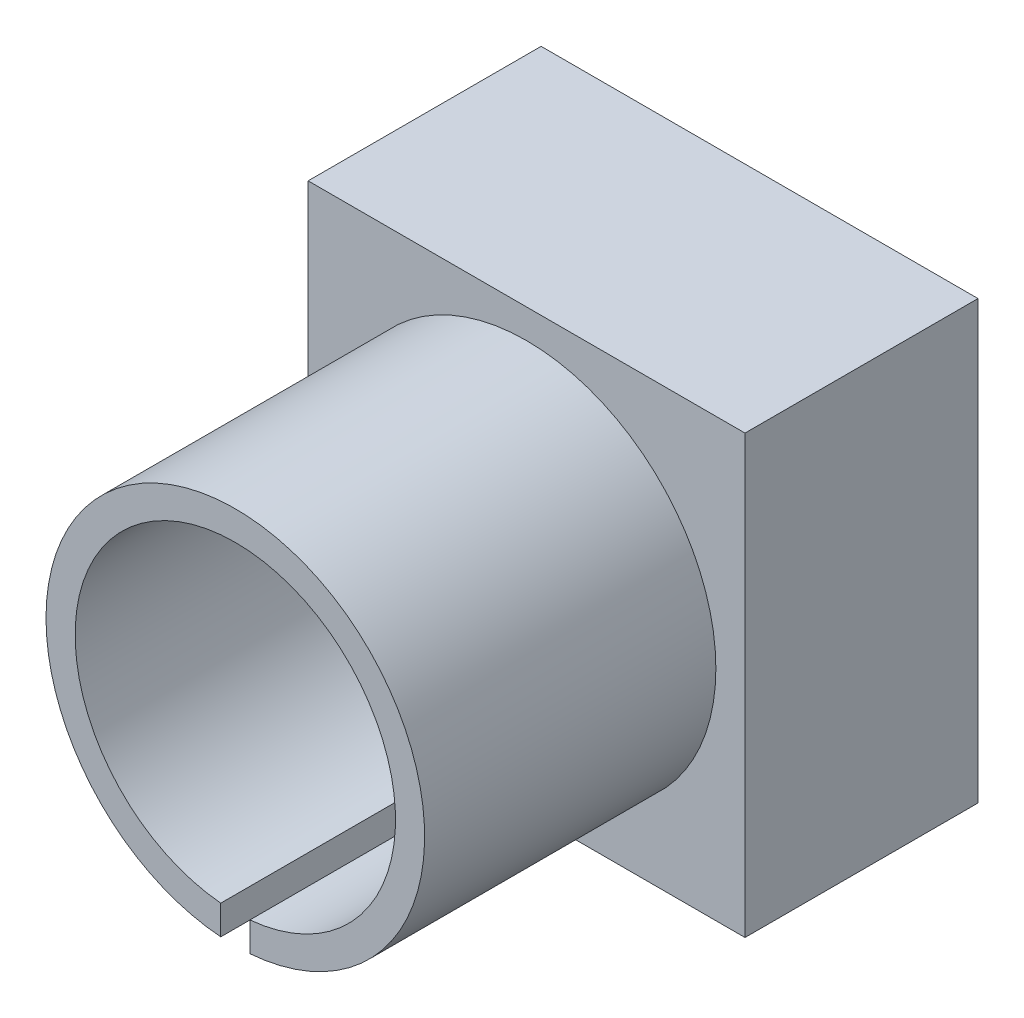
ISO-10303-21;
HEADER;
FILE_DESCRIPTION(('STEP AP214'),'2;1');
FILE_NAME('part.step','',(''),(''),'','','');
FILE_SCHEMA(('AUTOMOTIVE_DESIGN { 1 0 10303 214 1 1 1 1 }'));
ENDSEC;
DATA;
#1=APPLICATION_CONTEXT('core data for automotive mechanical design processes');
#2=APPLICATION_PROTOCOL_DEFINITION('international standard','automotive_design',2000,#1);
#3=PRODUCT_CONTEXT('',#1,'mechanical');
#4=PRODUCT('Part','Part','',(#3));
#5=PRODUCT_RELATED_PRODUCT_CATEGORY('part','',(#4));
#6=PRODUCT_DEFINITION_FORMATION('','',#4);
#7=PRODUCT_DEFINITION_CONTEXT('part definition',#1,'design');
#8=PRODUCT_DEFINITION('design','',#6,#7);
#9=PRODUCT_DEFINITION_SHAPE('','',#8);
#10=(LENGTH_UNIT() NAMED_UNIT(*) SI_UNIT(.MILLI.,.METRE.));
#11=(NAMED_UNIT(*) PLANE_ANGLE_UNIT() SI_UNIT($,.RADIAN.));
#12=(NAMED_UNIT(*) SI_UNIT($,.STERADIAN.) SOLID_ANGLE_UNIT());
#13=UNCERTAINTY_MEASURE_WITH_UNIT(LENGTH_MEASURE(1.E-05),#10,'distance_accuracy_value','');
#14=(GEOMETRIC_REPRESENTATION_CONTEXT(3) GLOBAL_UNCERTAINTY_ASSIGNED_CONTEXT((#13)) GLOBAL_UNIT_ASSIGNED_CONTEXT((#10,
#11,#12)) REPRESENTATION_CONTEXT('',''));
#15=CARTESIAN_POINT('',(0.,0.,0.));
#16=DIRECTION('',(0.,0.,1.));
#17=DIRECTION('',(1.,0.,0.));
#18=AXIS2_PLACEMENT_3D('',#15,#16,#17);
#19=CARTESIAN_POINT('',(-2.,0.,10.001));
#20=DIRECTION('',(0.,0.,-1.));
#21=DIRECTION('',(-1.,0.,0.));
#22=AXIS2_PLACEMENT_3D('',#19,#20,#21);
#23=CYLINDRICAL_SURFACE('',#22,0.75);
#24=CARTESIAN_POINT('',(-2.,0.,-1.59999999999998));
#25=DIRECTION('',(0.,0.,-1.));
#26=DIRECTION('',(-1.,0.,0.));
#27=AXIS2_PLACEMENT_3D('',#24,#25,#26);
#28=CIRCLE('',#27,0.75);
#29=CARTESIAN_POINT('',(-2.75,0.,-1.59999999999998));
#30=VERTEX_POINT('',#29);
#31=EDGE_CURVE('E53',#30,#30,#28,.T.);
#32=ORIENTED_EDGE('',*,*,#31,.T.);
#33=EDGE_LOOP('',(#32));
#34=FACE_BOUND('',#33,.T.);
#35=CARTESIAN_POINT('',(-2.,0.,0.));
#36=DIRECTION('',(0.,0.,-1.));
#37=DIRECTION('',(-1.,0.,0.));
#38=AXIS2_PLACEMENT_3D('',#35,#36,#37);
#39=CIRCLE('',#38,0.75);
#40=CARTESIAN_POINT('',(-2.75,0.,0.));
#41=VERTEX_POINT('',#40);
#42=EDGE_CURVE('E362',#41,#41,#39,.F.);
#43=ORIENTED_EDGE('',*,*,#42,.T.);
#44=EDGE_LOOP('',(#43));
#45=FACE_BOUND('',#44,.T.);
#46=ADVANCED_FACE('F43',(#34,#45),#23,.F.);
#47=CARTESIAN_POINT('',(-7.5,-7.5,-8.));
#48=DIRECTION('',(0.,-1.,0.));
#49=DIRECTION('',(1.,0.,0.));
#50=AXIS2_PLACEMENT_3D('',#47,#48,#49);
#51=PLANE('',#50);
#52=DIRECTION('',(1.,0.,0.));
#53=VECTOR('',#52,1.);
#54=CARTESIAN_POINT('',(-7.5,-7.5,0.));
#55=LINE('',#54,#53);
#56=CARTESIAN_POINT('',(-7.5,-7.5,0.));
#57=VERTEX_POINT('',#56);
#58=CARTESIAN_POINT('',(7.5,-7.5,0.));
#59=VERTEX_POINT('',#58);
#60=EDGE_CURVE('E148',#57,#59,#55,.T.);
#61=ORIENTED_EDGE('',*,*,#60,.F.);
#62=DIRECTION('',(0.,0.,1.));
#63=VECTOR('',#62,1.);
#64=CARTESIAN_POINT('',(-7.5,-7.5,-8.));
#65=LINE('',#64,#63);
#66=CARTESIAN_POINT('',(-7.5,-7.5,-8.));
#67=VERTEX_POINT('',#66);
#68=EDGE_CURVE('E69',#67,#57,#65,.T.);
#69=ORIENTED_EDGE('',*,*,#68,.F.);
#70=DIRECTION('',(1.,0.,0.));
#71=VECTOR('',#70,1.);
#72=CARTESIAN_POINT('',(-7.5,-7.5,-8.));
#73=LINE('',#72,#71);
#74=CARTESIAN_POINT('',(7.5,-7.5,-8.));
#75=VERTEX_POINT('',#74);
#76=EDGE_CURVE('E155',#67,#75,#73,.T.);
#77=ORIENTED_EDGE('',*,*,#76,.T.);
#78=DIRECTION('',(0.,0.,1.));
#79=VECTOR('',#78,1.);
#80=CARTESIAN_POINT('',(7.5,-7.5,-8.));
#81=LINE('',#80,#79);
#82=EDGE_CURVE('E167',#75,#59,#81,.T.);
#83=ORIENTED_EDGE('',*,*,#82,.T.);
#84=EDGE_LOOP('',(#61,#69,#77,#83));
#85=FACE_BOUND('',#84,.T.);
#86=ADVANCED_FACE('F216',(#85),#51,.T.);
#87=CARTESIAN_POINT('',(-7.5,7.5,-8.));
#88=DIRECTION('',(-1.,0.,0.));
#89=DIRECTION('',(0.,-1.,0.));
#90=AXIS2_PLACEMENT_3D('',#87,#88,#89);
#91=PLANE('',#90);
#92=DIRECTION('',(0.,-1.,0.));
#93=VECTOR('',#92,1.);
#94=CARTESIAN_POINT('',(-7.5,7.5,0.));
#95=LINE('',#94,#93);
#96=CARTESIAN_POINT('',(-7.5,7.5,0.));
#97=VERTEX_POINT('',#96);
#98=EDGE_CURVE('E158',#97,#57,#95,.T.);
#99=ORIENTED_EDGE('',*,*,#98,.F.);
#100=DIRECTION('',(0.,0.,1.));
#101=VECTOR('',#100,1.);
#102=CARTESIAN_POINT('',(-7.5,7.5,-8.));
#103=LINE('',#102,#101);
#104=CARTESIAN_POINT('',(-7.5,7.5,-8.));
#105=VERTEX_POINT('',#104);
#106=EDGE_CURVE('E183',#105,#97,#103,.T.);
#107=ORIENTED_EDGE('',*,*,#106,.F.);
#108=DIRECTION('',(0.,-1.,0.));
#109=VECTOR('',#108,1.);
#110=CARTESIAN_POINT('',(-7.5,7.5,-8.));
#111=LINE('',#110,#109);
#112=EDGE_CURVE('E164',#105,#67,#111,.T.);
#113=ORIENTED_EDGE('',*,*,#112,.T.);
#114=ORIENTED_EDGE('',*,*,#68,.T.);
#115=EDGE_LOOP('',(#99,#107,#113,#114));
#116=FACE_BOUND('',#115,.T.);
#117=ADVANCED_FACE('F221',(#116),#91,.T.);
#118=CARTESIAN_POINT('',(-7.5,7.5,-8.));
#119=DIRECTION('',(0.,-1.,0.));
#120=DIRECTION('',(1.,0.,0.));
#121=AXIS2_PLACEMENT_3D('',#118,#119,#120);
#122=PLANE('',#121);
#123=DIRECTION('',(1.,0.,0.));
#124=VECTOR('',#123,1.);
#125=CARTESIAN_POINT('',(-7.5,7.5,0.));
#126=LINE('',#125,#124);
#127=CARTESIAN_POINT('',(7.5,7.5,0.));
#128=VERTEX_POINT('',#127);
#129=EDGE_CURVE('E175',#97,#128,#126,.T.);
#130=ORIENTED_EDGE('',*,*,#129,.T.);
#131=DIRECTION('',(0.,0.,1.));
#132=VECTOR('',#131,1.);
#133=CARTESIAN_POINT('',(7.5,7.5,-8.));
#134=LINE('',#133,#132);
#135=CARTESIAN_POINT('',(7.5,7.5,-8.));
#136=VERTEX_POINT('',#135);
#137=EDGE_CURVE('E186',#136,#128,#134,.T.);
#138=ORIENTED_EDGE('',*,*,#137,.F.);
#139=DIRECTION('',(1.,0.,0.));
#140=VECTOR('',#139,1.);
#141=CARTESIAN_POINT('',(-7.5,7.5,-8.));
#142=LINE('',#141,#140);
#143=EDGE_CURVE('E161',#105,#136,#142,.T.);
#144=ORIENTED_EDGE('',*,*,#143,.F.);
#145=ORIENTED_EDGE('',*,*,#106,.T.);
#146=EDGE_LOOP('',(#130,#138,#144,#145));
#147=FACE_BOUND('',#146,.T.);
#148=ADVANCED_FACE('F253',(#147),#122,.F.);
#149=CARTESIAN_POINT('',(7.5,7.5,-8.));
#150=DIRECTION('',(-1.,0.,0.));
#151=DIRECTION('',(0.,-1.,0.));
#152=AXIS2_PLACEMENT_3D('',#149,#150,#151);
#153=PLANE('',#152);
#154=DIRECTION('',(0.,-1.,0.));
#155=VECTOR('',#154,1.);
#156=CARTESIAN_POINT('',(7.5,7.5,0.));
#157=LINE('',#156,#155);
#158=EDGE_CURVE('E171',#128,#59,#157,.T.);
#159=ORIENTED_EDGE('',*,*,#158,.T.);
#160=ORIENTED_EDGE('',*,*,#82,.F.);
#161=DIRECTION('',(0.,-1.,0.));
#162=VECTOR('',#161,1.);
#163=CARTESIAN_POINT('',(7.5,7.5,-8.));
#164=LINE('',#163,#162);
#165=EDGE_CURVE('E95',#136,#75,#164,.T.);
#166=ORIENTED_EDGE('',*,*,#165,.F.);
#167=ORIENTED_EDGE('',*,*,#137,.T.);
#168=EDGE_LOOP('',(#159,#160,#166,#167));
#169=FACE_BOUND('',#168,.T.);
#170=ADVANCED_FACE('F246',(#169),#153,.F.);
#171=CARTESIAN_POINT('',(0.,0.,-8.));
#172=DIRECTION('',(0.,0.,-1.));
#173=DIRECTION('',(-1.,0.,0.));
#174=AXIS2_PLACEMENT_3D('',#171,#172,#173);
#175=PLANE('',#174);
#176=CARTESIAN_POINT('',(-2.,0.,-8.));
#177=DIRECTION('',(0.,0.,-1.));
#178=DIRECTION('',(-1.,0.,0.));
#179=AXIS2_PLACEMENT_3D('',#176,#177,#178);
#180=CIRCLE('',#179,2.1);
#181=CARTESIAN_POINT('',(-4.1,0.,-8.));
#182=VERTEX_POINT('',#181);
#183=EDGE_CURVE('E366',#182,#182,#180,.T.);
#184=ORIENTED_EDGE('',*,*,#183,.F.);
#185=EDGE_LOOP('',(#184));
#186=FACE_BOUND('',#185,.T.);
#187=ORIENTED_EDGE('',*,*,#76,.F.);
#188=ORIENTED_EDGE('',*,*,#112,.F.);
#189=ORIENTED_EDGE('',*,*,#143,.T.);
#190=ORIENTED_EDGE('',*,*,#165,.T.);
#191=EDGE_LOOP('',(#187,#188,#189,#190));
#192=FACE_BOUND('',#191,.T.);
#193=ADVANCED_FACE('F243',(#186,#192),#175,.T.);
#194=CARTESIAN_POINT('',(0.,0.,0.));
#195=DIRECTION('',(0.,0.,-1.));
#196=DIRECTION('',(-1.,0.,0.));
#197=AXIS2_PLACEMENT_3D('',#194,#195,#196);
#198=PLANE('',#197);
#199=CARTESIAN_POINT('',(0.,0.,0.));
#200=DIRECTION('',(0.,0.,-1.));
#201=DIRECTION('',(-1.,0.,0.));
#202=AXIS2_PLACEMENT_3D('',#199,#200,#201);
#203=CIRCLE('',#202,6.5);
#204=CARTESIAN_POINT('',(-6.5,0.,0.));
#205=VERTEX_POINT('',#204);
#206=EDGE_CURVE('E127',#205,#205,#203,.F.);
#207=ORIENTED_EDGE('',*,*,#206,.F.);
#208=EDGE_LOOP('',(#207));
#209=FACE_BOUND('',#208,.T.);
#210=ORIENTED_EDGE('',*,*,#60,.T.);
#211=ORIENTED_EDGE('',*,*,#158,.F.);
#212=ORIENTED_EDGE('',*,*,#129,.F.);
#213=ORIENTED_EDGE('',*,*,#98,.T.);
#214=EDGE_LOOP('',(#210,#211,#212,#213));
#215=FACE_BOUND('',#214,.T.);
#216=ADVANCED_FACE('F242',(#209,#215),#198,.F.);
#217=CARTESIAN_POINT('',(0.,0.,10.));
#218=DIRECTION('',(0.,0.,-1.));
#219=DIRECTION('',(-1.,0.,0.));
#220=AXIS2_PLACEMENT_3D('',#217,#218,#219);
#221=CYLINDRICAL_SURFACE('',#220,5.5);
#222=DIRECTION('',(0.,0.,-1.));
#223=VECTOR('',#222,1.);
#224=CARTESIAN_POINT('',(-0.5,-5.47722557505166,10.));
#225=LINE('',#224,#223);
#226=CARTESIAN_POINT('',(-0.5,-5.47722557505166,3.));
#227=VERTEX_POINT('',#226);
#228=CARTESIAN_POINT('',(-0.5,-5.47722557505166,10.));
#229=VERTEX_POINT('',#228);
#230=EDGE_CURVE('E382',#227,#229,#225,.F.);
#231=ORIENTED_EDGE('',*,*,#230,.F.);
#232=CARTESIAN_POINT('',(0.,0.,3.));
#233=DIRECTION('',(0.,0.,-1.));
#234=DIRECTION('',(-1.,0.,0.));
#235=AXIS2_PLACEMENT_3D('',#232,#233,#234);
#236=CIRCLE('',#235,5.5);
#237=CARTESIAN_POINT('',(0.5,-5.47722557505166,3.));
#238=VERTEX_POINT('',#237);
#239=EDGE_CURVE('E136',#238,#227,#236,.T.);
#240=ORIENTED_EDGE('',*,*,#239,.F.);
#241=DIRECTION('',(0.,0.,-1.));
#242=VECTOR('',#241,1.);
#243=CARTESIAN_POINT('',(0.5,-5.47722557505166,10.));
#244=LINE('',#243,#242);
#245=CARTESIAN_POINT('',(0.5,-5.47722557505166,10.));
#246=VERTEX_POINT('',#245);
#247=EDGE_CURVE('E119',#246,#238,#244,.T.);
#248=ORIENTED_EDGE('',*,*,#247,.F.);
#249=CARTESIAN_POINT('',(0.,0.,10.));
#250=DIRECTION('',(0.,0.,1.));
#251=DIRECTION('',(1.,0.,0.));
#252=AXIS2_PLACEMENT_3D('',#249,#250,#251);
#253=CIRCLE('',#252,5.5);
#254=EDGE_CURVE('E135',#246,#229,#253,.T.);
#255=ORIENTED_EDGE('',*,*,#254,.T.);
#256=EDGE_LOOP('',(#231,#240,#248,#255));
#257=FACE_BOUND('',#256,.T.);
#258=CARTESIAN_POINT('',(0.,0.,0.));
#259=DIRECTION('',(0.,0.,1.));
#260=DIRECTION('',(1.,0.,0.));
#261=AXIS2_PLACEMENT_3D('',#258,#259,#260);
#262=CIRCLE('',#261,5.5);
#263=CARTESIAN_POINT('',(5.5,0.,0.));
#264=VERTEX_POINT('',#263);
#265=EDGE_CURVE('E144',#264,#264,#262,.T.);
#266=ORIENTED_EDGE('',*,*,#265,.F.);
#267=EDGE_LOOP('',(#266));
#268=FACE_BOUND('',#267,.T.);
#269=ADVANCED_FACE('F133',(#257,#268),#221,.F.);
#270=CARTESIAN_POINT('',(0.,0.,10.));
#271=DIRECTION('',(0.,0.,-1.));
#272=DIRECTION('',(-1.,0.,0.));
#273=AXIS2_PLACEMENT_3D('',#270,#271,#272);
#274=CYLINDRICAL_SURFACE('',#273,6.5);
#275=CARTESIAN_POINT('',(0.,0.,3.));
#276=DIRECTION('',(0.,0.,-1.));
#277=DIRECTION('',(-1.,0.,0.));
#278=AXIS2_PLACEMENT_3D('',#275,#276,#277);
#279=CIRCLE('',#278,6.5);
#280=CARTESIAN_POINT('',(0.5,-6.48074069840786,3.));
#281=VERTEX_POINT('',#280);
#282=CARTESIAN_POINT('',(-0.5,-6.48074069840786,3.));
#283=VERTEX_POINT('',#282);
#284=EDGE_CURVE('E197',#281,#283,#279,.T.);
#285=ORIENTED_EDGE('',*,*,#284,.T.);
#286=DIRECTION('',(0.,0.,-1.));
#287=VECTOR('',#286,1.);
#288=CARTESIAN_POINT('',(-0.5,-6.48074069840786,10.));
#289=LINE('',#288,#287);
#290=CARTESIAN_POINT('',(-0.5,-6.48074069840786,10.));
#291=VERTEX_POINT('',#290);
#292=EDGE_CURVE('E138',#283,#291,#289,.F.);
#293=ORIENTED_EDGE('',*,*,#292,.T.);
#294=CARTESIAN_POINT('',(0.,0.,10.));
#295=DIRECTION('',(0.,0.,1.));
#296=DIRECTION('',(1.,0.,0.));
#297=AXIS2_PLACEMENT_3D('',#294,#295,#296);
#298=CIRCLE('',#297,6.5);
#299=CARTESIAN_POINT('',(0.5,-6.48074069840786,10.));
#300=VERTEX_POINT('',#299);
#301=EDGE_CURVE('E143',#300,#291,#298,.T.);
#302=ORIENTED_EDGE('',*,*,#301,.F.);
#303=DIRECTION('',(0.,0.,-1.));
#304=VECTOR('',#303,1.);
#305=CARTESIAN_POINT('',(0.5,-6.48074069840786,10.));
#306=LINE('',#305,#304);
#307=EDGE_CURVE('E60',#300,#281,#306,.T.);
#308=ORIENTED_EDGE('',*,*,#307,.T.);
#309=EDGE_LOOP('',(#285,#293,#302,#308));
#310=FACE_BOUND('',#309,.T.);
#311=ORIENTED_EDGE('',*,*,#206,.T.);
#312=EDGE_LOOP('',(#311));
#313=FACE_BOUND('',#312,.T.);
#314=ADVANCED_FACE('F236',(#310,#313),#274,.T.);
#315=CARTESIAN_POINT('',(0.,0.,10.));
#316=DIRECTION('',(0.,0.,1.));
#317=DIRECTION('',(1.,0.,0.));
#318=AXIS2_PLACEMENT_3D('',#315,#316,#317);
#319=PLANE('',#318);
#320=DIRECTION('',(0.,-1.,0.));
#321=VECTOR('',#320,1.);
#322=CARTESIAN_POINT('',(-0.5,0.,10.));
#323=LINE('',#322,#321);
#324=EDGE_CURVE('E126',#229,#291,#323,.T.);
#325=ORIENTED_EDGE('',*,*,#324,.F.);
#326=ORIENTED_EDGE('',*,*,#254,.F.);
#327=DIRECTION('',(0.,1.,0.));
#328=VECTOR('',#327,1.);
#329=CARTESIAN_POINT('',(0.5,0.,10.));
#330=LINE('',#329,#328);
#331=EDGE_CURVE('E116',#300,#246,#330,.T.);
#332=ORIENTED_EDGE('',*,*,#331,.F.);
#333=ORIENTED_EDGE('',*,*,#301,.T.);
#334=EDGE_LOOP('',(#325,#326,#332,#333));
#335=FACE_BOUND('',#334,.T.);
#336=ADVANCED_FACE('F141',(#335),#319,.T.);
#337=ORIENTED_EDGE('',*,*,#42,.F.);
#338=EDGE_LOOP('',(#337));
#339=FACE_BOUND('',#338,.T.);
#340=ORIENTED_EDGE('',*,*,#265,.T.);
#341=EDGE_LOOP('',(#340));
#342=FACE_BOUND('',#341,.T.);
#343=ADVANCED_FACE('F227',(#339,#342),#198,.F.);
#344=CARTESIAN_POINT('',(-0.5,-10.,3.));
#345=DIRECTION('',(0.,0.,-1.));
#346=DIRECTION('',(-1.,0.,0.));
#347=AXIS2_PLACEMENT_3D('',#344,#345,#346);
#348=PLANE('',#347);
#349=ORIENTED_EDGE('',*,*,#239,.T.);
#350=DIRECTION('',(0.,1.,0.));
#351=VECTOR('',#350,1.);
#352=CARTESIAN_POINT('',(-0.5,-10.,3.));
#353=LINE('',#352,#351);
#354=EDGE_CURVE('E370',#283,#227,#353,.T.);
#355=ORIENTED_EDGE('',*,*,#354,.F.);
#356=ORIENTED_EDGE('',*,*,#284,.F.);
#357=DIRECTION('',(0.,1.,0.));
#358=VECTOR('',#357,1.);
#359=CARTESIAN_POINT('',(0.5,-10.,3.));
#360=LINE('',#359,#358);
#361=EDGE_CURVE('E365',#281,#238,#360,.T.);
#362=ORIENTED_EDGE('',*,*,#361,.T.);
#363=EDGE_LOOP('',(#349,#355,#356,#362));
#364=FACE_BOUND('',#363,.T.);
#365=ADVANCED_FACE('F223',(#364),#348,.F.);
#366=CARTESIAN_POINT('',(-0.5,-10.,10.));
#367=DIRECTION('',(-1.,0.,0.));
#368=DIRECTION('',(0.,0.,1.));
#369=AXIS2_PLACEMENT_3D('',#366,#367,#368);
#370=PLANE('',#369);
#371=ORIENTED_EDGE('',*,*,#230,.T.);
#372=ORIENTED_EDGE('',*,*,#324,.T.);
#373=ORIENTED_EDGE('',*,*,#292,.F.);
#374=ORIENTED_EDGE('',*,*,#354,.T.);
#375=EDGE_LOOP('',(#371,#372,#373,#374));
#376=FACE_BOUND('',#375,.T.);
#377=ADVANCED_FACE('F226',(#376),#370,.F.);
#378=CARTESIAN_POINT('',(0.5,-10.,10.));
#379=DIRECTION('',(1.,0.,0.));
#380=DIRECTION('',(0.,0.,-1.));
#381=AXIS2_PLACEMENT_3D('',#378,#379,#380);
#382=PLANE('',#381);
#383=ORIENTED_EDGE('',*,*,#247,.T.);
#384=ORIENTED_EDGE('',*,*,#361,.F.);
#385=ORIENTED_EDGE('',*,*,#307,.F.);
#386=ORIENTED_EDGE('',*,*,#331,.T.);
#387=EDGE_LOOP('',(#383,#384,#385,#386));
#388=FACE_BOUND('',#387,.T.);
#389=ADVANCED_FACE('F118',(#388),#382,.F.);
#390=CARTESIAN_POINT('',(-2.,0.,-3.));
#391=DIRECTION('',(0.,0.,-1.));
#392=DIRECTION('',(-1.,0.,0.));
#393=AXIS2_PLACEMENT_3D('',#390,#391,#392);
#394=CYLINDRICAL_SURFACE('',#393,2.1);
#395=CARTESIAN_POINT('',(-2.,0.,-2.94999999999999));
#396=DIRECTION('',(0.,0.,-1.));
#397=DIRECTION('',(-1.,0.,0.));
#398=AXIS2_PLACEMENT_3D('',#395,#396,#397);
#399=CIRCLE('',#398,2.1);
#400=CARTESIAN_POINT('',(-4.1,0.,-2.94999999999999));
#401=VERTEX_POINT('',#400);
#402=EDGE_CURVE('E11',#401,#401,#399,.F.);
#403=ORIENTED_EDGE('',*,*,#402,.T.);
#404=EDGE_LOOP('',(#403));
#405=FACE_BOUND('',#404,.T.);
#406=ORIENTED_EDGE('',*,*,#183,.T.);
#407=EDGE_LOOP('',(#406));
#408=FACE_BOUND('',#407,.T.);
#409=ADVANCED_FACE('F207',(#405,#408),#394,.F.);
#410=CARTESIAN_POINT('',(-2.,0.,-1.59999999999998));
#411=DIRECTION('',(0.,0.,-1.));
#412=DIRECTION('',(-1.,0.,0.));
#413=AXIS2_PLACEMENT_3D('',#410,#411,#412);
#414=CONICAL_SURFACE('',#413,0.75,0.785398163397444);
#415=CARTESIAN_POINT('',(-4.1,0.,-2.94999999999999));
#416=CARTESIAN_POINT('',(-4.0859375,0.,-2.93593749999999));
#417=CARTESIAN_POINT('',(-4.071875,0.,-2.92187499999999));
#418=CARTESIAN_POINT('',(-4.04375,0.,-2.89374999999999));
#419=CARTESIAN_POINT('',(-4.0296875,0.,-2.87968749999999));
#420=CARTESIAN_POINT('',(-4.0015625,0.,-2.85156249999999));
#421=CARTESIAN_POINT('',(-3.9875,0.,-2.83749999999999));
#422=CARTESIAN_POINT('',(-3.959375,0.,-2.80937499999999));
#423=CARTESIAN_POINT('',(-3.9453125,0.,-2.79531249999999));
#424=CARTESIAN_POINT('',(-3.9171875,0.,-2.76718749999998));
#425=CARTESIAN_POINT('',(-3.903125,0.,-2.75312499999999));
#426=CARTESIAN_POINT('',(-3.875,0.,-2.72499999999998));
#427=CARTESIAN_POINT('',(-3.8609375,0.,-2.71093749999998));
#428=CARTESIAN_POINT('',(-3.8328125,0.,-2.68281249999998));
#429=CARTESIAN_POINT('',(-3.81875,0.,-2.66874999999998));
#430=CARTESIAN_POINT('',(-3.790625,0.,-2.64062499999998));
#431=CARTESIAN_POINT('',(-3.7765625,0.,-2.62656249999998));
#432=CARTESIAN_POINT('',(-3.7484375,0.,-2.59843749999998));
#433=CARTESIAN_POINT('',(-3.734375,0.,-2.58437499999998));
#434=CARTESIAN_POINT('',(-3.70625,0.,-2.55624999999998));
#435=CARTESIAN_POINT('',(-3.6921875,0.,-2.54218749999998));
#436=CARTESIAN_POINT('',(-3.6640625,0.,-2.51406249999998));
#437=CARTESIAN_POINT('',(-3.65,0.,-2.49999999999998));
#438=CARTESIAN_POINT('',(-3.621875,0.,-2.47187499999998));
#439=CARTESIAN_POINT('',(-3.6078125,0.,-2.45781249999998));
#440=CARTESIAN_POINT('',(-3.5796875,0.,-2.42968749999998));
#441=CARTESIAN_POINT('',(-3.565625,0.,-2.41562499999998));
#442=CARTESIAN_POINT('',(-3.5375,0.,-2.38749999999998));
#443=CARTESIAN_POINT('',(-3.5234375,0.,-2.37343749999998));
#444=CARTESIAN_POINT('',(-3.4953125,0.,-2.34531249999998));
#445=CARTESIAN_POINT('',(-3.48125,0.,-2.33124999999998));
#446=CARTESIAN_POINT('',(-3.453125,0.,-2.30312499999998));
#447=CARTESIAN_POINT('',(-3.4390625,0.,-2.28906249999998));
#448=CARTESIAN_POINT('',(-3.4109375,0.,-2.26093749999998));
#449=CARTESIAN_POINT('',(-3.396875,0.,-2.24687499999998));
#450=CARTESIAN_POINT('',(-3.36875,0.,-2.21874999999998));
#451=CARTESIAN_POINT('',(-3.3546875,0.,-2.20468749999998));
#452=CARTESIAN_POINT('',(-3.3265625,0.,-2.17656249999998));
#453=CARTESIAN_POINT('',(-3.3125,0.,-2.16249999999998));
#454=CARTESIAN_POINT('',(-3.284375,0.,-2.13437499999998));
#455=CARTESIAN_POINT('',(-3.2703125,0.,-2.12031249999998));
#456=CARTESIAN_POINT('',(-3.2421875,0.,-2.09218749999998));
#457=CARTESIAN_POINT('',(-3.228125,0.,-2.07812499999998));
#458=CARTESIAN_POINT('',(-3.2,0.,-2.04999999999998));
#459=CARTESIAN_POINT('',(-3.1859375,0.,-2.03593749999998));
#460=CARTESIAN_POINT('',(-3.1578125,0.,-2.00781249999998));
#461=CARTESIAN_POINT('',(-3.14375,0.,-1.99374999999998));
#462=CARTESIAN_POINT('',(-3.115625,0.,-1.96562499999998));
#463=CARTESIAN_POINT('',(-3.1015625,0.,-1.95156249999998));
#464=CARTESIAN_POINT('',(-3.0734375,0.,-1.92343749999998));
#465=CARTESIAN_POINT('',(-3.059375,0.,-1.90937499999998));
#466=CARTESIAN_POINT('',(-3.03125,0.,-1.88124999999998));
#467=CARTESIAN_POINT('',(-3.0171875,0.,-1.86718749999998));
#468=CARTESIAN_POINT('',(-2.9890625,0.,-1.83906249999998));
#469=CARTESIAN_POINT('',(-2.975,0.,-1.82499999999998));
#470=CARTESIAN_POINT('',(-2.946875,0.,-1.79687499999998));
#471=CARTESIAN_POINT('',(-2.9328125,0.,-1.78281249999998));
#472=CARTESIAN_POINT('',(-2.9046875,0.,-1.75468749999998));
#473=CARTESIAN_POINT('',(-2.890625,0.,-1.74062499999998));
#474=CARTESIAN_POINT('',(-2.8625,0.,-1.71249999999998));
#475=CARTESIAN_POINT('',(-2.8484375,0.,-1.69843749999998));
#476=CARTESIAN_POINT('',(-2.8203125,0.,-1.67031249999998));
#477=CARTESIAN_POINT('',(-2.80625,0.,-1.65624999999998));
#478=CARTESIAN_POINT('',(-2.778125,0.,-1.62812499999998));
#479=CARTESIAN_POINT('',(-2.7640625,0.,-1.61406249999998));
#480=CARTESIAN_POINT('',(-2.75,0.,-1.59999999999998));
#481=B_SPLINE_CURVE_WITH_KNOTS('',3,(#415,#416,#417,#418,#419,#420,#421,#422,#423,#424,#425,
#426,#427,#428,#429,#430,#431,#432,#433,#434,#435,#436,#437,#438,#439,#440,#441,#442,#443,#444,
#445,#446,#447,#448,#449,#450,#451,#452,#453,#454,#455,#456,#457,#458,#459,#460,#461,#462,#463,
#464,#465,#466,#467,#468,#469,#470,#471,#472,#473,#474,#475,#476,#477,#478,#479,#480),
.UNSPECIFIED.,.F.,.F.,(4,2,2,2,2,2,2,2,2,2,2,2,2,2,2,2,2,2,2,2,2,2,2,2,2,2,2,2,2,2,2,2,4),(0.,
0.0596621346626148,0.11932426932523,0.178986403987845,0.23864853865046,0.298310673313076,
0.35797280797569,0.417634942638306,0.477297077300921,0.536959211963536,0.596621346626151,
0.656283481288766,0.715945615951381,0.775607750613996,0.835269885276612,0.894932019939226,
0.954594154601842,1.01425628926446,1.07391842392707,1.13358055858969,1.1932426932523,
1.25290482791492,1.31256696257753,1.37222909724015,1.43189123190276,1.49155336656538,
1.55121550122799,1.61087763589061,1.67053977055322,1.73020190521584,1.78986403987845,
1.84952617454107,1.90918830920368),.UNSPECIFIED.);
#482=EDGE_CURVE('BSEAM46',#401,#30,#481,.T.);
#483=ORIENTED_EDGE('',*,*,#402,.F.);
#484=ORIENTED_EDGE('',*,*,#31,.F.);
#485=ORIENTED_EDGE('',*,*,#482,.T.);
#486=ORIENTED_EDGE('',*,*,#482,.F.);
#487=EDGE_LOOP('',(#483,#485,#484,#486));
#488=FACE_BOUND('',#487,.T.);
#489=ADVANCED_FACE('F46',(#488),#414,.F.);
#490=CLOSED_SHELL('',(#46,#86,#117,#148,#170,#193,#216,#269,#314,#336,#343,#365,#377,#389,#409,#489));
#491=MANIFOLD_SOLID_BREP('B2',#490);
#492=ADVANCED_BREP_SHAPE_REPRESENTATION('',(#18,#491),#14);
#493=SHAPE_DEFINITION_REPRESENTATION(#9,#492);
ENDSEC;
END-ISO-10303-21;
